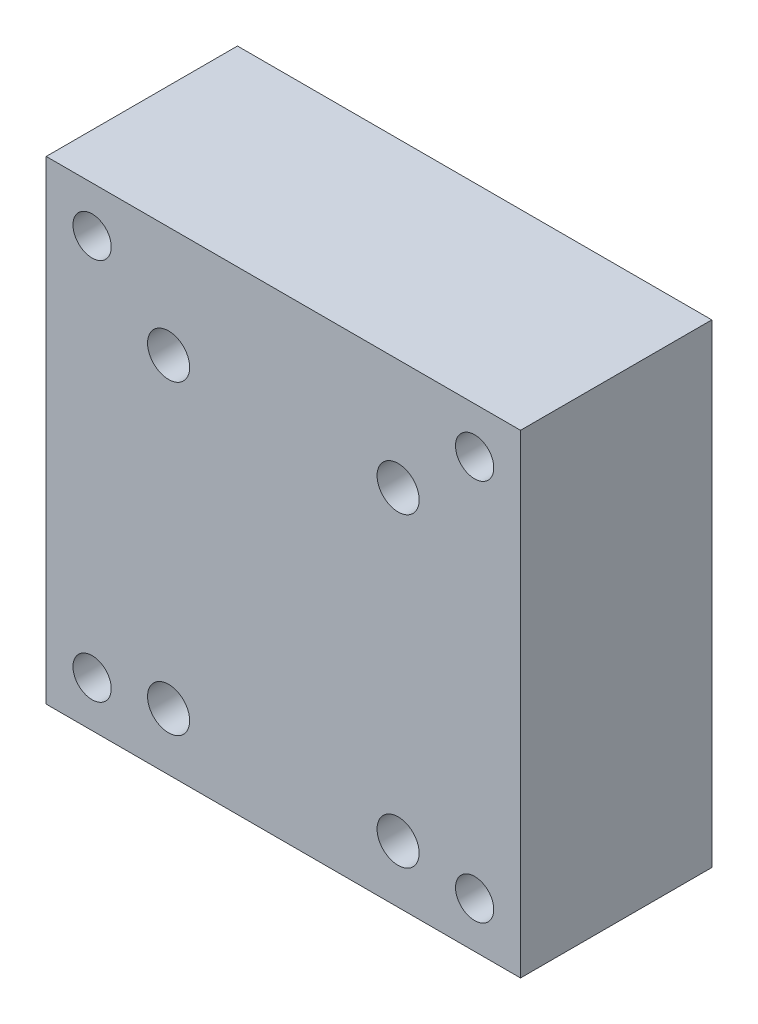
ISO-10303-21;
HEADER;
FILE_DESCRIPTION(('STEP AP214'),'2;1');
FILE_NAME('part.step','',(''),(''),'','','');
FILE_SCHEMA(('AUTOMOTIVE_DESIGN { 1 0 10303 214 1 1 1 1 }'));
ENDSEC;
DATA;
#1=APPLICATION_CONTEXT('core data for automotive mechanical design processes');
#2=APPLICATION_PROTOCOL_DEFINITION('international standard','automotive_design',2000,#1);
#3=PRODUCT_CONTEXT('',#1,'mechanical');
#4=PRODUCT('Part','Part','',(#3));
#5=PRODUCT_RELATED_PRODUCT_CATEGORY('part','',(#4));
#6=PRODUCT_DEFINITION_FORMATION('','',#4);
#7=PRODUCT_DEFINITION_CONTEXT('part definition',#1,'design');
#8=PRODUCT_DEFINITION('design','',#6,#7);
#9=PRODUCT_DEFINITION_SHAPE('','',#8);
#10=(LENGTH_UNIT() NAMED_UNIT(*) SI_UNIT(.MILLI.,.METRE.));
#11=(NAMED_UNIT(*) PLANE_ANGLE_UNIT() SI_UNIT($,.RADIAN.));
#12=(NAMED_UNIT(*) SI_UNIT($,.STERADIAN.) SOLID_ANGLE_UNIT());
#13=UNCERTAINTY_MEASURE_WITH_UNIT(LENGTH_MEASURE(1.E-05),#10,'distance_accuracy_value','');
#14=(GEOMETRIC_REPRESENTATION_CONTEXT(3) GLOBAL_UNCERTAINTY_ASSIGNED_CONTEXT((#13)) GLOBAL_UNIT_ASSIGNED_CONTEXT((#10,
#11,#12)) REPRESENTATION_CONTEXT('',''));
#15=CARTESIAN_POINT('',(0.,0.,0.));
#16=DIRECTION('',(0.,0.,1.));
#17=DIRECTION('',(1.,0.,0.));
#18=AXIS2_PLACEMENT_3D('',#15,#16,#17);
#19=CARTESIAN_POINT('',(0.,0.,0.));
#20=DIRECTION('',(0.,0.,1.));
#21=DIRECTION('',(1.,0.,0.));
#22=AXIS2_PLACEMENT_3D('',#19,#20,#21);
#23=PLANE('',#22);
#24=CARTESIAN_POINT('',(15.,16.5,0.));
#25=DIRECTION('',(0.,0.,-1.));
#26=DIRECTION('',(-1.,0.,0.));
#27=AXIS2_PLACEMENT_3D('',#24,#25,#26);
#28=CIRCLE('',#27,5.);
#29=CARTESIAN_POINT('',(10.,16.5,0.));
#30=VERTEX_POINT('',#29);
#31=EDGE_CURVE('E187',#30,#30,#28,.T.);
#32=ORIENTED_EDGE('',*,*,#31,.F.);
#33=EDGE_LOOP('',(#32));
#34=FACE_BOUND('',#33,.T.);
#35=CARTESIAN_POINT('',(-15.,16.5,0.));
#36=DIRECTION('',(0.,0.,-1.));
#37=DIRECTION('',(-1.,0.,0.));
#38=AXIS2_PLACEMENT_3D('',#35,#36,#37);
#39=CIRCLE('',#38,5.);
#40=CARTESIAN_POINT('',(-20.,16.5,0.));
#41=VERTEX_POINT('',#40);
#42=EDGE_CURVE('E175',#41,#41,#39,.T.);
#43=ORIENTED_EDGE('',*,*,#42,.F.);
#44=EDGE_LOOP('',(#43));
#45=FACE_BOUND('',#44,.T.);
#46=CARTESIAN_POINT('',(-15.,-23.5,0.));
#47=DIRECTION('',(0.,0.,-1.));
#48=DIRECTION('',(-1.,0.,0.));
#49=AXIS2_PLACEMENT_3D('',#46,#47,#48);
#50=CIRCLE('',#49,5.);
#51=CARTESIAN_POINT('',(-20.,-23.5,0.));
#52=VERTEX_POINT('',#51);
#53=EDGE_CURVE('E163',#52,#52,#50,.T.);
#54=ORIENTED_EDGE('',*,*,#53,.F.);
#55=EDGE_LOOP('',(#54));
#56=FACE_BOUND('',#55,.T.);
#57=CARTESIAN_POINT('',(15.,-23.5,0.));
#58=DIRECTION('',(0.,0.,-1.));
#59=DIRECTION('',(-1.,0.,0.));
#60=AXIS2_PLACEMENT_3D('',#57,#58,#59);
#61=CIRCLE('',#60,5.);
#62=CARTESIAN_POINT('',(9.99999999999999,-23.5,0.));
#63=VERTEX_POINT('',#62);
#64=EDGE_CURVE('E151',#63,#63,#61,.T.);
#65=ORIENTED_EDGE('',*,*,#64,.F.);
#66=EDGE_LOOP('',(#65));
#67=FACE_BOUND('',#66,.T.);
#68=CARTESIAN_POINT('',(25.,25.,0.));
#69=DIRECTION('',(0.,0.,-1.));
#70=DIRECTION('',(-1.,0.,0.));
#71=AXIS2_PLACEMENT_3D('',#68,#69,#70);
#72=CIRCLE('',#71,2.49999999999999);
#73=CARTESIAN_POINT('',(22.5,25.,0.));
#74=VERTEX_POINT('',#73);
#75=EDGE_CURVE('E139',#74,#74,#72,.T.);
#76=ORIENTED_EDGE('',*,*,#75,.F.);
#77=EDGE_LOOP('',(#76));
#78=FACE_BOUND('',#77,.T.);
#79=CARTESIAN_POINT('',(-25.,25.,0.));
#80=DIRECTION('',(0.,0.,-1.));
#81=DIRECTION('',(-1.,0.,0.));
#82=AXIS2_PLACEMENT_3D('',#79,#80,#81);
#83=CIRCLE('',#82,2.49999999999999);
#84=CARTESIAN_POINT('',(-27.5,25.,0.));
#85=VERTEX_POINT('',#84);
#86=EDGE_CURVE('E133',#85,#85,#83,.T.);
#87=ORIENTED_EDGE('',*,*,#86,.F.);
#88=EDGE_LOOP('',(#87));
#89=FACE_BOUND('',#88,.T.);
#90=CARTESIAN_POINT('',(25.,-25.,0.));
#91=DIRECTION('',(0.,0.,-1.));
#92=DIRECTION('',(-1.,0.,0.));
#93=AXIS2_PLACEMENT_3D('',#90,#91,#92);
#94=CIRCLE('',#93,2.49999999999999);
#95=CARTESIAN_POINT('',(22.5,-25.,0.));
#96=VERTEX_POINT('',#95);
#97=EDGE_CURVE('E127',#96,#96,#94,.T.);
#98=ORIENTED_EDGE('',*,*,#97,.F.);
#99=EDGE_LOOP('',(#98));
#100=FACE_BOUND('',#99,.T.);
#101=DIRECTION('',(0.,1.,0.));
#102=VECTOR('',#101,1.);
#103=CARTESIAN_POINT('',(31.,31.,0.));
#104=LINE('',#103,#102);
#105=CARTESIAN_POINT('',(31.,-31.,0.));
#106=VERTEX_POINT('',#105);
#107=CARTESIAN_POINT('',(31.,31.,0.));
#108=VERTEX_POINT('',#107);
#109=EDGE_CURVE('E105',#106,#108,#104,.T.);
#110=ORIENTED_EDGE('',*,*,#109,.F.);
#111=DIRECTION('',(1.,0.,0.));
#112=VECTOR('',#111,1.);
#113=CARTESIAN_POINT('',(-31.,-31.,0.));
#114=LINE('',#113,#112);
#115=CARTESIAN_POINT('',(-31.,-31.,0.));
#116=VERTEX_POINT('',#115);
#117=EDGE_CURVE('E80',#116,#106,#114,.T.);
#118=ORIENTED_EDGE('',*,*,#117,.F.);
#119=DIRECTION('',(0.,-1.,0.));
#120=VECTOR('',#119,1.);
#121=CARTESIAN_POINT('',(-31.,31.,0.));
#122=LINE('',#121,#120);
#123=CARTESIAN_POINT('',(-31.,31.,0.));
#124=VERTEX_POINT('',#123);
#125=EDGE_CURVE('E74',#124,#116,#122,.T.);
#126=ORIENTED_EDGE('',*,*,#125,.F.);
#127=DIRECTION('',(-1.,0.,0.));
#128=VECTOR('',#127,1.);
#129=CARTESIAN_POINT('',(-31.,31.,0.));
#130=LINE('',#129,#128);
#131=EDGE_CURVE('E97',#108,#124,#130,.T.);
#132=ORIENTED_EDGE('',*,*,#131,.F.);
#133=EDGE_LOOP('',(#110,#118,#126,#132));
#134=FACE_BOUND('',#133,.T.);
#135=CARTESIAN_POINT('',(-25.,-25.,0.));
#136=DIRECTION('',(0.,0.,-1.));
#137=DIRECTION('',(-1.,0.,0.));
#138=AXIS2_PLACEMENT_3D('',#135,#136,#137);
#139=CIRCLE('',#138,2.49999999999999);
#140=CARTESIAN_POINT('',(-27.5,-25.,0.));
#141=VERTEX_POINT('',#140);
#142=EDGE_CURVE('E121',#141,#141,#139,.T.);
#143=ORIENTED_EDGE('',*,*,#142,.F.);
#144=EDGE_LOOP('',(#143));
#145=FACE_BOUND('',#144,.T.);
#146=ADVANCED_FACE('F40',(#34,#45,#56,#67,#78,#89,#100,#134,#145),#23,.F.);
#147=CARTESIAN_POINT('',(0.,0.,25.));
#148=DIRECTION('',(0.,0.,1.));
#149=DIRECTION('',(1.,0.,0.));
#150=AXIS2_PLACEMENT_3D('',#147,#148,#149);
#151=PLANE('',#150);
#152=CARTESIAN_POINT('',(15.,16.5,25.));
#153=DIRECTION('',(0.,0.,-1.));
#154=DIRECTION('',(-1.,0.,0.));
#155=AXIS2_PLACEMENT_3D('',#152,#153,#154);
#156=CIRCLE('',#155,2.74999999999999);
#157=CARTESIAN_POINT('',(12.25,16.5,25.));
#158=VERTEX_POINT('',#157);
#159=EDGE_CURVE('E178',#158,#158,#156,.T.);
#160=ORIENTED_EDGE('',*,*,#159,.T.);
#161=EDGE_LOOP('',(#160));
#162=FACE_BOUND('',#161,.T.);
#163=CARTESIAN_POINT('',(-15.,16.5,25.));
#164=DIRECTION('',(0.,0.,-1.));
#165=DIRECTION('',(-1.,0.,0.));
#166=AXIS2_PLACEMENT_3D('',#163,#164,#165);
#167=CIRCLE('',#166,2.74999999999999);
#168=CARTESIAN_POINT('',(-17.75,16.5,25.));
#169=VERTEX_POINT('',#168);
#170=EDGE_CURVE('E166',#169,#169,#167,.T.);
#171=ORIENTED_EDGE('',*,*,#170,.T.);
#172=EDGE_LOOP('',(#171));
#173=FACE_BOUND('',#172,.T.);
#174=CARTESIAN_POINT('',(-15.,-23.5,25.));
#175=DIRECTION('',(0.,0.,-1.));
#176=DIRECTION('',(-1.,0.,0.));
#177=AXIS2_PLACEMENT_3D('',#174,#175,#176);
#178=CIRCLE('',#177,2.74999999999999);
#179=CARTESIAN_POINT('',(-17.75,-23.5,25.));
#180=VERTEX_POINT('',#179);
#181=EDGE_CURVE('E154',#180,#180,#178,.T.);
#182=ORIENTED_EDGE('',*,*,#181,.T.);
#183=EDGE_LOOP('',(#182));
#184=FACE_BOUND('',#183,.T.);
#185=CARTESIAN_POINT('',(15.,-23.5,25.));
#186=DIRECTION('',(0.,0.,-1.));
#187=DIRECTION('',(-1.,0.,0.));
#188=AXIS2_PLACEMENT_3D('',#185,#186,#187);
#189=CIRCLE('',#188,2.74999999999999);
#190=CARTESIAN_POINT('',(12.25,-23.5,25.));
#191=VERTEX_POINT('',#190);
#192=EDGE_CURVE('E142',#191,#191,#189,.T.);
#193=ORIENTED_EDGE('',*,*,#192,.T.);
#194=EDGE_LOOP('',(#193));
#195=FACE_BOUND('',#194,.T.);
#196=CARTESIAN_POINT('',(25.,25.,25.));
#197=DIRECTION('',(0.,0.,-1.));
#198=DIRECTION('',(-1.,0.,0.));
#199=AXIS2_PLACEMENT_3D('',#196,#197,#198);
#200=CIRCLE('',#199,2.5);
#201=CARTESIAN_POINT('',(22.5,25.,25.));
#202=VERTEX_POINT('',#201);
#203=EDGE_CURVE('E136',#202,#202,#200,.T.);
#204=ORIENTED_EDGE('',*,*,#203,.T.);
#205=EDGE_LOOP('',(#204));
#206=FACE_BOUND('',#205,.T.);
#207=CARTESIAN_POINT('',(-25.,25.,25.));
#208=DIRECTION('',(0.,0.,-1.));
#209=DIRECTION('',(-1.,0.,0.));
#210=AXIS2_PLACEMENT_3D('',#207,#208,#209);
#211=CIRCLE('',#210,2.5);
#212=CARTESIAN_POINT('',(-27.5,25.,25.));
#213=VERTEX_POINT('',#212);
#214=EDGE_CURVE('E130',#213,#213,#211,.T.);
#215=ORIENTED_EDGE('',*,*,#214,.T.);
#216=EDGE_LOOP('',(#215));
#217=FACE_BOUND('',#216,.T.);
#218=CARTESIAN_POINT('',(25.,-25.,25.));
#219=DIRECTION('',(0.,0.,-1.));
#220=DIRECTION('',(-1.,0.,0.));
#221=AXIS2_PLACEMENT_3D('',#218,#219,#220);
#222=CIRCLE('',#221,2.5);
#223=CARTESIAN_POINT('',(22.5,-25.,25.));
#224=VERTEX_POINT('',#223);
#225=EDGE_CURVE('E124',#224,#224,#222,.T.);
#226=ORIENTED_EDGE('',*,*,#225,.T.);
#227=EDGE_LOOP('',(#226));
#228=FACE_BOUND('',#227,.T.);
#229=DIRECTION('',(0.,1.,0.));
#230=VECTOR('',#229,1.);
#231=CARTESIAN_POINT('',(31.,31.,25.));
#232=LINE('',#231,#230);
#233=CARTESIAN_POINT('',(31.,-31.,25.));
#234=VERTEX_POINT('',#233);
#235=CARTESIAN_POINT('',(31.,31.,25.));
#236=VERTEX_POINT('',#235);
#237=EDGE_CURVE('E93',#234,#236,#232,.T.);
#238=ORIENTED_EDGE('',*,*,#237,.T.);
#239=DIRECTION('',(-1.,0.,0.));
#240=VECTOR('',#239,1.);
#241=CARTESIAN_POINT('',(-31.,31.,25.));
#242=LINE('',#241,#240);
#243=CARTESIAN_POINT('',(-31.,31.,25.));
#244=VERTEX_POINT('',#243);
#245=EDGE_CURVE('E87',#236,#244,#242,.T.);
#246=ORIENTED_EDGE('',*,*,#245,.T.);
#247=DIRECTION('',(0.,-1.,0.));
#248=VECTOR('',#247,1.);
#249=CARTESIAN_POINT('',(-31.,31.,25.));
#250=LINE('',#249,#248);
#251=CARTESIAN_POINT('',(-31.,-31.,25.));
#252=VERTEX_POINT('',#251);
#253=EDGE_CURVE('E91',#244,#252,#250,.T.);
#254=ORIENTED_EDGE('',*,*,#253,.T.);
#255=DIRECTION('',(1.,0.,0.));
#256=VECTOR('',#255,1.);
#257=CARTESIAN_POINT('',(-31.,-31.,25.));
#258=LINE('',#257,#256);
#259=EDGE_CURVE('E57',#252,#234,#258,.T.);
#260=ORIENTED_EDGE('',*,*,#259,.T.);
#261=EDGE_LOOP('',(#238,#246,#254,#260));
#262=FACE_BOUND('',#261,.T.);
#263=CARTESIAN_POINT('',(-25.,-25.,25.));
#264=DIRECTION('',(0.,0.,-1.));
#265=DIRECTION('',(-1.,0.,0.));
#266=AXIS2_PLACEMENT_3D('',#263,#264,#265);
#267=CIRCLE('',#266,2.5);
#268=CARTESIAN_POINT('',(-27.5,-25.,25.));
#269=VERTEX_POINT('',#268);
#270=EDGE_CURVE('E108',#269,#269,#267,.T.);
#271=ORIENTED_EDGE('',*,*,#270,.T.);
#272=EDGE_LOOP('',(#271));
#273=FACE_BOUND('',#272,.T.);
#274=ADVANCED_FACE('F88',(#162,#173,#184,#195,#206,#217,#228,#262,#273),#151,.T.);
#275=CARTESIAN_POINT('',(31.,31.,25.));
#276=DIRECTION('',(-1.,0.,0.));
#277=DIRECTION('',(0.,-1.,0.));
#278=AXIS2_PLACEMENT_3D('',#275,#276,#277);
#279=PLANE('',#278);
#280=ORIENTED_EDGE('',*,*,#109,.T.);
#281=DIRECTION('',(0.,0.,-1.));
#282=VECTOR('',#281,1.);
#283=CARTESIAN_POINT('',(31.,31.,25.));
#284=LINE('',#283,#282);
#285=EDGE_CURVE('E11',#236,#108,#284,.T.);
#286=ORIENTED_EDGE('',*,*,#285,.F.);
#287=ORIENTED_EDGE('',*,*,#237,.F.);
#288=DIRECTION('',(0.,0.,-1.));
#289=VECTOR('',#288,1.);
#290=CARTESIAN_POINT('',(31.,-31.,25.));
#291=LINE('',#290,#289);
#292=EDGE_CURVE('E101',#234,#106,#291,.T.);
#293=ORIENTED_EDGE('',*,*,#292,.T.);
#294=EDGE_LOOP('',(#280,#286,#287,#293));
#295=FACE_BOUND('',#294,.T.);
#296=ADVANCED_FACE('F42',(#295),#279,.F.);
#297=CARTESIAN_POINT('',(-31.,31.,25.));
#298=DIRECTION('',(0.,-1.,0.));
#299=DIRECTION('',(0.,0.,-1.));
#300=AXIS2_PLACEMENT_3D('',#297,#298,#299);
#301=PLANE('',#300);
#302=ORIENTED_EDGE('',*,*,#131,.T.);
#303=DIRECTION('',(0.,0.,-1.));
#304=VECTOR('',#303,1.);
#305=CARTESIAN_POINT('',(-31.,31.,25.));
#306=LINE('',#305,#304);
#307=EDGE_CURVE('E49',#244,#124,#306,.T.);
#308=ORIENTED_EDGE('',*,*,#307,.F.);
#309=ORIENTED_EDGE('',*,*,#245,.F.);
#310=ORIENTED_EDGE('',*,*,#285,.T.);
#311=EDGE_LOOP('',(#302,#308,#309,#310));
#312=FACE_BOUND('',#311,.T.);
#313=ADVANCED_FACE('F96',(#312),#301,.F.);
#314=CARTESIAN_POINT('',(-31.,31.,25.));
#315=DIRECTION('',(1.,0.,0.));
#316=DIRECTION('',(0.,1.,0.));
#317=AXIS2_PLACEMENT_3D('',#314,#315,#316);
#318=PLANE('',#317);
#319=ORIENTED_EDGE('',*,*,#125,.T.);
#320=DIRECTION('',(0.,0.,-1.));
#321=VECTOR('',#320,1.);
#322=CARTESIAN_POINT('',(-31.,-31.,25.));
#323=LINE('',#322,#321);
#324=EDGE_CURVE('E98',#252,#116,#323,.T.);
#325=ORIENTED_EDGE('',*,*,#324,.F.);
#326=ORIENTED_EDGE('',*,*,#253,.F.);
#327=ORIENTED_EDGE('',*,*,#307,.T.);
#328=EDGE_LOOP('',(#319,#325,#326,#327));
#329=FACE_BOUND('',#328,.T.);
#330=ADVANCED_FACE('F99',(#329),#318,.F.);
#331=CARTESIAN_POINT('',(-31.,-31.,25.));
#332=DIRECTION('',(0.,1.,0.));
#333=DIRECTION('',(0.,0.,1.));
#334=AXIS2_PLACEMENT_3D('',#331,#332,#333);
#335=PLANE('',#334);
#336=ORIENTED_EDGE('',*,*,#117,.T.);
#337=ORIENTED_EDGE('',*,*,#292,.F.);
#338=ORIENTED_EDGE('',*,*,#259,.F.);
#339=ORIENTED_EDGE('',*,*,#324,.T.);
#340=EDGE_LOOP('',(#336,#337,#338,#339));
#341=FACE_BOUND('',#340,.T.);
#342=ADVANCED_FACE('F113',(#341),#335,.F.);
#343=CARTESIAN_POINT('',(-25.,-25.,0.));
#344=DIRECTION('',(0.,0.,-1.));
#345=DIRECTION('',(-1.,0.,0.));
#346=AXIS2_PLACEMENT_3D('',#343,#344,#345);
#347=CYLINDRICAL_SURFACE('',#346,2.49999999999999);
#348=ORIENTED_EDGE('',*,*,#270,.F.);
#349=EDGE_LOOP('',(#348));
#350=FACE_BOUND('',#349,.T.);
#351=ORIENTED_EDGE('',*,*,#142,.T.);
#352=EDGE_LOOP('',(#351));
#353=FACE_BOUND('',#352,.T.);
#354=ADVANCED_FACE('F211',(#350,#353),#347,.F.);
#355=CARTESIAN_POINT('',(25.,-25.,0.));
#356=DIRECTION('',(0.,0.,-1.));
#357=DIRECTION('',(-1.,0.,0.));
#358=AXIS2_PLACEMENT_3D('',#355,#356,#357);
#359=CYLINDRICAL_SURFACE('',#358,2.49999999999999);
#360=ORIENTED_EDGE('',*,*,#225,.F.);
#361=EDGE_LOOP('',(#360));
#362=FACE_BOUND('',#361,.T.);
#363=ORIENTED_EDGE('',*,*,#97,.T.);
#364=EDGE_LOOP('',(#363));
#365=FACE_BOUND('',#364,.T.);
#366=ADVANCED_FACE('F208',(#362,#365),#359,.F.);
#367=CARTESIAN_POINT('',(-25.,25.,0.));
#368=DIRECTION('',(0.,0.,-1.));
#369=DIRECTION('',(-1.,0.,0.));
#370=AXIS2_PLACEMENT_3D('',#367,#368,#369);
#371=CYLINDRICAL_SURFACE('',#370,2.49999999999999);
#372=ORIENTED_EDGE('',*,*,#214,.F.);
#373=EDGE_LOOP('',(#372));
#374=FACE_BOUND('',#373,.T.);
#375=ORIENTED_EDGE('',*,*,#86,.T.);
#376=EDGE_LOOP('',(#375));
#377=FACE_BOUND('',#376,.T.);
#378=ADVANCED_FACE('F210',(#374,#377),#371,.F.);
#379=CARTESIAN_POINT('',(25.,25.,0.));
#380=DIRECTION('',(0.,0.,-1.));
#381=DIRECTION('',(-1.,0.,0.));
#382=AXIS2_PLACEMENT_3D('',#379,#380,#381);
#383=CYLINDRICAL_SURFACE('',#382,2.49999999999999);
#384=ORIENTED_EDGE('',*,*,#203,.F.);
#385=EDGE_LOOP('',(#384));
#386=FACE_BOUND('',#385,.T.);
#387=ORIENTED_EDGE('',*,*,#75,.T.);
#388=EDGE_LOOP('',(#387));
#389=FACE_BOUND('',#388,.T.);
#390=ADVANCED_FACE('F218',(#386,#389),#383,.F.);
#391=CARTESIAN_POINT('',(15.,-23.5,0.));
#392=DIRECTION('',(0.,0.,-1.));
#393=DIRECTION('',(-1.,0.,0.));
#394=AXIS2_PLACEMENT_3D('',#391,#392,#393);
#395=CYLINDRICAL_SURFACE('',#394,2.74999999999999);
#396=ORIENTED_EDGE('',*,*,#192,.F.);
#397=EDGE_LOOP('',(#396));
#398=FACE_BOUND('',#397,.T.);
#399=CARTESIAN_POINT('',(15.,-23.5,20.));
#400=DIRECTION('',(0.,0.,-1.));
#401=DIRECTION('',(-1.,0.,0.));
#402=AXIS2_PLACEMENT_3D('',#399,#400,#401);
#403=CIRCLE('',#402,2.75);
#404=CARTESIAN_POINT('',(12.25,-23.5,20.));
#405=VERTEX_POINT('',#404);
#406=EDGE_CURVE('E145',#405,#405,#403,.T.);
#407=ORIENTED_EDGE('',*,*,#406,.T.);
#408=EDGE_LOOP('',(#407));
#409=FACE_BOUND('',#408,.T.);
#410=ADVANCED_FACE('F258',(#398,#409),#395,.F.);
#411=CARTESIAN_POINT('',(17.75,-23.5,20.));
#412=DIRECTION('',(0.,0.,1.));
#413=DIRECTION('',(1.,0.,0.));
#414=AXIS2_PLACEMENT_3D('',#411,#412,#413);
#415=PLANE('',#414);
#416=ORIENTED_EDGE('',*,*,#406,.F.);
#417=EDGE_LOOP('',(#416));
#418=FACE_BOUND('',#417,.T.);
#419=CARTESIAN_POINT('',(15.,-23.5,20.));
#420=DIRECTION('',(0.,0.,-1.));
#421=DIRECTION('',(-1.,0.,0.));
#422=AXIS2_PLACEMENT_3D('',#419,#420,#421);
#423=CIRCLE('',#422,4.99999999999999);
#424=CARTESIAN_POINT('',(10.,-23.5,20.));
#425=VERTEX_POINT('',#424);
#426=EDGE_CURVE('E148',#425,#425,#423,.T.);
#427=ORIENTED_EDGE('',*,*,#426,.T.);
#428=EDGE_LOOP('',(#427));
#429=FACE_BOUND('',#428,.T.);
#430=ADVANCED_FACE('F308',(#418,#429),#415,.F.);
#431=CARTESIAN_POINT('',(15.,-23.5,0.));
#432=DIRECTION('',(0.,0.,-1.));
#433=DIRECTION('',(-1.,0.,0.));
#434=AXIS2_PLACEMENT_3D('',#431,#432,#433);
#435=CYLINDRICAL_SURFACE('',#434,5.);
#436=ORIENTED_EDGE('',*,*,#426,.F.);
#437=EDGE_LOOP('',(#436));
#438=FACE_BOUND('',#437,.T.);
#439=ORIENTED_EDGE('',*,*,#64,.T.);
#440=EDGE_LOOP('',(#439));
#441=FACE_BOUND('',#440,.T.);
#442=ADVANCED_FACE('F315',(#438,#441),#435,.F.);
#443=CARTESIAN_POINT('',(-15.,-23.5,0.));
#444=DIRECTION('',(0.,0.,-1.));
#445=DIRECTION('',(-1.,0.,0.));
#446=AXIS2_PLACEMENT_3D('',#443,#444,#445);
#447=CYLINDRICAL_SURFACE('',#446,2.74999999999999);
#448=ORIENTED_EDGE('',*,*,#181,.F.);
#449=EDGE_LOOP('',(#448));
#450=FACE_BOUND('',#449,.T.);
#451=CARTESIAN_POINT('',(-15.,-23.5,20.));
#452=DIRECTION('',(0.,0.,-1.));
#453=DIRECTION('',(-1.,0.,0.));
#454=AXIS2_PLACEMENT_3D('',#451,#452,#453);
#455=CIRCLE('',#454,2.75);
#456=CARTESIAN_POINT('',(-17.75,-23.5,20.));
#457=VERTEX_POINT('',#456);
#458=EDGE_CURVE('E157',#457,#457,#455,.T.);
#459=ORIENTED_EDGE('',*,*,#458,.T.);
#460=EDGE_LOOP('',(#459));
#461=FACE_BOUND('',#460,.T.);
#462=ADVANCED_FACE('F323',(#450,#461),#447,.F.);
#463=CARTESIAN_POINT('',(-12.25,-23.5,20.));
#464=DIRECTION('',(0.,0.,1.));
#465=DIRECTION('',(1.,0.,0.));
#466=AXIS2_PLACEMENT_3D('',#463,#464,#465);
#467=PLANE('',#466);
#468=ORIENTED_EDGE('',*,*,#458,.F.);
#469=EDGE_LOOP('',(#468));
#470=FACE_BOUND('',#469,.T.);
#471=CARTESIAN_POINT('',(-15.,-23.5,20.));
#472=DIRECTION('',(0.,0.,-1.));
#473=DIRECTION('',(-1.,0.,0.));
#474=AXIS2_PLACEMENT_3D('',#471,#472,#473);
#475=CIRCLE('',#474,5.);
#476=CARTESIAN_POINT('',(-20.,-23.5,20.));
#477=VERTEX_POINT('',#476);
#478=EDGE_CURVE('E160',#477,#477,#475,.T.);
#479=ORIENTED_EDGE('',*,*,#478,.T.);
#480=EDGE_LOOP('',(#479));
#481=FACE_BOUND('',#480,.T.);
#482=ADVANCED_FACE('F331',(#470,#481),#467,.F.);
#483=CARTESIAN_POINT('',(-15.,-23.5,0.));
#484=DIRECTION('',(0.,0.,-1.));
#485=DIRECTION('',(-1.,0.,0.));
#486=AXIS2_PLACEMENT_3D('',#483,#484,#485);
#487=CYLINDRICAL_SURFACE('',#486,5.);
#488=ORIENTED_EDGE('',*,*,#478,.F.);
#489=EDGE_LOOP('',(#488));
#490=FACE_BOUND('',#489,.T.);
#491=ORIENTED_EDGE('',*,*,#53,.T.);
#492=EDGE_LOOP('',(#491));
#493=FACE_BOUND('',#492,.T.);
#494=ADVANCED_FACE('F339',(#490,#493),#487,.F.);
#495=CARTESIAN_POINT('',(-15.,16.5,0.));
#496=DIRECTION('',(0.,0.,-1.));
#497=DIRECTION('',(-1.,0.,0.));
#498=AXIS2_PLACEMENT_3D('',#495,#496,#497);
#499=CYLINDRICAL_SURFACE('',#498,2.74999999999999);
#500=ORIENTED_EDGE('',*,*,#170,.F.);
#501=EDGE_LOOP('',(#500));
#502=FACE_BOUND('',#501,.T.);
#503=CARTESIAN_POINT('',(-15.,16.5,20.));
#504=DIRECTION('',(0.,0.,-1.));
#505=DIRECTION('',(-1.,0.,0.));
#506=AXIS2_PLACEMENT_3D('',#503,#504,#505);
#507=CIRCLE('',#506,2.75);
#508=CARTESIAN_POINT('',(-17.75,16.5,20.));
#509=VERTEX_POINT('',#508);
#510=EDGE_CURVE('E169',#509,#509,#507,.T.);
#511=ORIENTED_EDGE('',*,*,#510,.T.);
#512=EDGE_LOOP('',(#511));
#513=FACE_BOUND('',#512,.T.);
#514=ADVANCED_FACE('F347',(#502,#513),#499,.F.);
#515=CARTESIAN_POINT('',(-12.25,16.5,20.));
#516=DIRECTION('',(0.,0.,1.));
#517=DIRECTION('',(1.,0.,0.));
#518=AXIS2_PLACEMENT_3D('',#515,#516,#517);
#519=PLANE('',#518);
#520=ORIENTED_EDGE('',*,*,#510,.F.);
#521=EDGE_LOOP('',(#520));
#522=FACE_BOUND('',#521,.T.);
#523=CARTESIAN_POINT('',(-15.,16.5,20.));
#524=DIRECTION('',(0.,0.,-1.));
#525=DIRECTION('',(-1.,0.,0.));
#526=AXIS2_PLACEMENT_3D('',#523,#524,#525);
#527=CIRCLE('',#526,5.);
#528=CARTESIAN_POINT('',(-20.,16.5,20.));
#529=VERTEX_POINT('',#528);
#530=EDGE_CURVE('E172',#529,#529,#527,.T.);
#531=ORIENTED_EDGE('',*,*,#530,.T.);
#532=EDGE_LOOP('',(#531));
#533=FACE_BOUND('',#532,.T.);
#534=ADVANCED_FACE('F355',(#522,#533),#519,.F.);
#535=CARTESIAN_POINT('',(-15.,16.5,0.));
#536=DIRECTION('',(0.,0.,-1.));
#537=DIRECTION('',(-1.,0.,0.));
#538=AXIS2_PLACEMENT_3D('',#535,#536,#537);
#539=CYLINDRICAL_SURFACE('',#538,5.);
#540=ORIENTED_EDGE('',*,*,#530,.F.);
#541=EDGE_LOOP('',(#540));
#542=FACE_BOUND('',#541,.T.);
#543=ORIENTED_EDGE('',*,*,#42,.T.);
#544=EDGE_LOOP('',(#543));
#545=FACE_BOUND('',#544,.T.);
#546=ADVANCED_FACE('F363',(#542,#545),#539,.F.);
#547=CARTESIAN_POINT('',(15.,16.5,0.));
#548=DIRECTION('',(0.,0.,-1.));
#549=DIRECTION('',(-1.,0.,0.));
#550=AXIS2_PLACEMENT_3D('',#547,#548,#549);
#551=CYLINDRICAL_SURFACE('',#550,2.74999999999999);
#552=ORIENTED_EDGE('',*,*,#159,.F.);
#553=EDGE_LOOP('',(#552));
#554=FACE_BOUND('',#553,.T.);
#555=CARTESIAN_POINT('',(15.,16.5,20.));
#556=DIRECTION('',(0.,0.,-1.));
#557=DIRECTION('',(-1.,0.,0.));
#558=AXIS2_PLACEMENT_3D('',#555,#556,#557);
#559=CIRCLE('',#558,2.74999999999999);
#560=CARTESIAN_POINT('',(12.25,16.5,20.));
#561=VERTEX_POINT('',#560);
#562=EDGE_CURVE('E181',#561,#561,#559,.T.);
#563=ORIENTED_EDGE('',*,*,#562,.T.);
#564=EDGE_LOOP('',(#563));
#565=FACE_BOUND('',#564,.T.);
#566=ADVANCED_FACE('F371',(#554,#565),#551,.F.);
#567=CARTESIAN_POINT('',(17.75,16.5,20.));
#568=DIRECTION('',(0.,0.,1.));
#569=DIRECTION('',(1.,0.,0.));
#570=AXIS2_PLACEMENT_3D('',#567,#568,#569);
#571=PLANE('',#570);
#572=ORIENTED_EDGE('',*,*,#562,.F.);
#573=EDGE_LOOP('',(#572));
#574=FACE_BOUND('',#573,.T.);
#575=CARTESIAN_POINT('',(15.,16.5,20.));
#576=DIRECTION('',(0.,0.,-1.));
#577=DIRECTION('',(-1.,0.,0.));
#578=AXIS2_PLACEMENT_3D('',#575,#576,#577);
#579=CIRCLE('',#578,5.);
#580=CARTESIAN_POINT('',(10.,16.5,20.));
#581=VERTEX_POINT('',#580);
#582=EDGE_CURVE('E184',#581,#581,#579,.T.);
#583=ORIENTED_EDGE('',*,*,#582,.T.);
#584=EDGE_LOOP('',(#583));
#585=FACE_BOUND('',#584,.T.);
#586=ADVANCED_FACE('F379',(#574,#585),#571,.F.);
#587=CARTESIAN_POINT('',(15.,16.5,0.));
#588=DIRECTION('',(0.,0.,-1.));
#589=DIRECTION('',(-1.,0.,0.));
#590=AXIS2_PLACEMENT_3D('',#587,#588,#589);
#591=CYLINDRICAL_SURFACE('',#590,5.);
#592=ORIENTED_EDGE('',*,*,#582,.F.);
#593=EDGE_LOOP('',(#592));
#594=FACE_BOUND('',#593,.T.);
#595=ORIENTED_EDGE('',*,*,#31,.T.);
#596=EDGE_LOOP('',(#595));
#597=FACE_BOUND('',#596,.T.);
#598=ADVANCED_FACE('F191',(#594,#597),#591,.F.);
#599=CLOSED_SHELL('',(#146,#274,#296,#313,#330,#342,#354,#366,#378,#390,#410,#430,#442,#462,
#482,#494,#514,#534,#546,#566,#586,#598));
#600=MANIFOLD_SOLID_BREP('B2',#599);
#601=ADVANCED_BREP_SHAPE_REPRESENTATION('',(#18,#600),#14);
#602=SHAPE_DEFINITION_REPRESENTATION(#9,#601);
ENDSEC;
END-ISO-10303-21;
